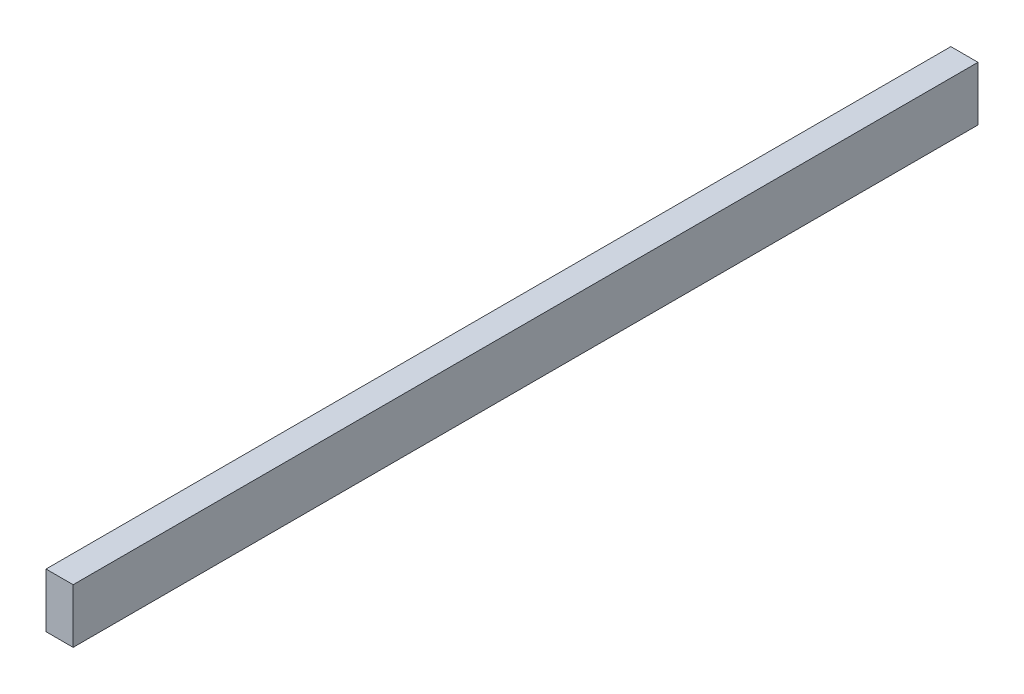
ISO-10303-21;
HEADER;
FILE_DESCRIPTION(('STEP AP214'),'2;1');
FILE_NAME('part.step','',(''),(''),'','','');
FILE_SCHEMA(('AUTOMOTIVE_DESIGN { 1 0 10303 214 1 1 1 1 }'));
ENDSEC;
DATA;
#1=APPLICATION_CONTEXT('core data for automotive mechanical design processes');
#2=APPLICATION_PROTOCOL_DEFINITION('international standard','automotive_design',2000,#1);
#3=PRODUCT_CONTEXT('',#1,'mechanical');
#4=PRODUCT('Part','Part','',(#3));
#5=PRODUCT_RELATED_PRODUCT_CATEGORY('part','',(#4));
#6=PRODUCT_DEFINITION_FORMATION('','',#4);
#7=PRODUCT_DEFINITION_CONTEXT('part definition',#1,'design');
#8=PRODUCT_DEFINITION('design','',#6,#7);
#9=PRODUCT_DEFINITION_SHAPE('','',#8);
#10=(LENGTH_UNIT() NAMED_UNIT(*) SI_UNIT(.MILLI.,.METRE.));
#11=(NAMED_UNIT(*) PLANE_ANGLE_UNIT() SI_UNIT($,.RADIAN.));
#12=(NAMED_UNIT(*) SI_UNIT($,.STERADIAN.) SOLID_ANGLE_UNIT());
#13=UNCERTAINTY_MEASURE_WITH_UNIT(LENGTH_MEASURE(1.E-05),#10,'distance_accuracy_value','');
#14=(GEOMETRIC_REPRESENTATION_CONTEXT(3) GLOBAL_UNCERTAINTY_ASSIGNED_CONTEXT((#13)) GLOBAL_UNIT_ASSIGNED_CONTEXT((#10,
#11,#12)) REPRESENTATION_CONTEXT('',''));
#15=CARTESIAN_POINT('',(0.,0.,0.));
#16=DIRECTION('',(0.,0.,1.));
#17=DIRECTION('',(1.,0.,0.));
#18=AXIS2_PLACEMENT_3D('',#15,#16,#17);
#19=CARTESIAN_POINT('',(0.,-2.7952788750285,100.));
#20=DIRECTION('',(-1.,0.,0.));
#21=DIRECTION('',(0.,-1.,0.));
#22=AXIS2_PLACEMENT_3D('',#19,#20,#21);
#23=PLANE('',#22);
#24=DIRECTION('',(0.,1.,0.));
#25=VECTOR('',#24,1.);
#26=CARTESIAN_POINT('',(0.,-2.7952788750285,0.));
#27=LINE('',#26,#25);
#28=CARTESIAN_POINT('',(0.,-2.7952788750285,0.));
#29=VERTEX_POINT('',#28);
#30=CARTESIAN_POINT('',(0.,3.2047211249715,0.));
#31=VERTEX_POINT('',#30);
#32=EDGE_CURVE('E96',#29,#31,#27,.T.);
#33=ORIENTED_EDGE('',*,*,#32,.T.);
#34=DIRECTION('',(0.,0.,-1.));
#35=VECTOR('',#34,1.);
#36=CARTESIAN_POINT('',(0.,3.2047211249715,100.));
#37=LINE('',#36,#35);
#38=CARTESIAN_POINT('',(0.,3.2047211249715,100.));
#39=VERTEX_POINT('',#38);
#40=EDGE_CURVE('E11',#39,#31,#37,.T.);
#41=ORIENTED_EDGE('',*,*,#40,.F.);
#42=DIRECTION('',(0.,1.,0.));
#43=VECTOR('',#42,1.);
#44=CARTESIAN_POINT('',(0.,-2.7952788750285,100.));
#45=LINE('',#44,#43);
#46=CARTESIAN_POINT('',(0.,-2.7952788750285,100.));
#47=VERTEX_POINT('',#46);
#48=EDGE_CURVE('E84',#47,#39,#45,.T.);
#49=ORIENTED_EDGE('',*,*,#48,.F.);
#50=DIRECTION('',(0.,0.,-1.));
#51=VECTOR('',#50,1.);
#52=CARTESIAN_POINT('',(0.,-2.7952788750285,100.));
#53=LINE('',#52,#51);
#54=EDGE_CURVE('E92',#47,#29,#53,.T.);
#55=ORIENTED_EDGE('',*,*,#54,.T.);
#56=EDGE_LOOP('',(#33,#41,#49,#55));
#57=FACE_BOUND('',#56,.T.);
#58=ADVANCED_FACE('F33',(#57),#23,.F.);
#59=CARTESIAN_POINT('',(0.,3.2047211249715,100.));
#60=DIRECTION('',(0.,-1.,0.));
#61=DIRECTION('',(0.,0.,-1.));
#62=AXIS2_PLACEMENT_3D('',#59,#60,#61);
#63=PLANE('',#62);
#64=DIRECTION('',(-1.,0.,0.));
#65=VECTOR('',#64,1.);
#66=CARTESIAN_POINT('',(0.,3.2047211249715,0.));
#67=LINE('',#66,#65);
#68=CARTESIAN_POINT('',(-3.,3.2047211249715,0.));
#69=VERTEX_POINT('',#68);
#70=EDGE_CURVE('E88',#31,#69,#67,.T.);
#71=ORIENTED_EDGE('',*,*,#70,.T.);
#72=DIRECTION('',(0.,0.,-1.));
#73=VECTOR('',#72,1.);
#74=CARTESIAN_POINT('',(-3.,3.2047211249715,100.));
#75=LINE('',#74,#73);
#76=CARTESIAN_POINT('',(-3.,3.2047211249715,100.));
#77=VERTEX_POINT('',#76);
#78=EDGE_CURVE('E41',#77,#69,#75,.T.);
#79=ORIENTED_EDGE('',*,*,#78,.F.);
#80=DIRECTION('',(-1.,0.,0.));
#81=VECTOR('',#80,1.);
#82=CARTESIAN_POINT('',(0.,3.2047211249715,100.));
#83=LINE('',#82,#81);
#84=EDGE_CURVE('E79',#39,#77,#83,.T.);
#85=ORIENTED_EDGE('',*,*,#84,.F.);
#86=ORIENTED_EDGE('',*,*,#40,.T.);
#87=EDGE_LOOP('',(#71,#79,#85,#86));
#88=FACE_BOUND('',#87,.T.);
#89=ADVANCED_FACE('F87',(#88),#63,.F.);
#90=CARTESIAN_POINT('',(-3.,-2.7952788750285,100.));
#91=DIRECTION('',(1.,0.,0.));
#92=DIRECTION('',(0.,0.,-1.));
#93=AXIS2_PLACEMENT_3D('',#90,#91,#92);
#94=PLANE('',#93);
#95=DIRECTION('',(0.,-1.,0.));
#96=VECTOR('',#95,1.);
#97=CARTESIAN_POINT('',(-3.,-2.7952788750285,0.));
#98=LINE('',#97,#96);
#99=CARTESIAN_POINT('',(-3.,-2.7952788750285,0.));
#100=VERTEX_POINT('',#99);
#101=EDGE_CURVE('E66',#69,#100,#98,.T.);
#102=ORIENTED_EDGE('',*,*,#101,.T.);
#103=DIRECTION('',(0.,0.,-1.));
#104=VECTOR('',#103,1.);
#105=CARTESIAN_POINT('',(-3.,-2.7952788750285,100.));
#106=LINE('',#105,#104);
#107=CARTESIAN_POINT('',(-3.,-2.7952788750285,100.));
#108=VERTEX_POINT('',#107);
#109=EDGE_CURVE('E89',#108,#100,#106,.T.);
#110=ORIENTED_EDGE('',*,*,#109,.F.);
#111=DIRECTION('',(0.,-1.,0.));
#112=VECTOR('',#111,1.);
#113=CARTESIAN_POINT('',(-3.,-2.7952788750285,100.));
#114=LINE('',#113,#112);
#115=EDGE_CURVE('E82',#77,#108,#114,.T.);
#116=ORIENTED_EDGE('',*,*,#115,.F.);
#117=ORIENTED_EDGE('',*,*,#78,.T.);
#118=EDGE_LOOP('',(#102,#110,#116,#117));
#119=FACE_BOUND('',#118,.T.);
#120=ADVANCED_FACE('F90',(#119),#94,.F.);
#121=CARTESIAN_POINT('',(0.,-2.7952788750285,100.));
#122=DIRECTION('',(0.,1.,0.));
#123=DIRECTION('',(-1.,0.,0.));
#124=AXIS2_PLACEMENT_3D('',#121,#122,#123);
#125=PLANE('',#124);
#126=DIRECTION('',(1.,0.,0.));
#127=VECTOR('',#126,1.);
#128=CARTESIAN_POINT('',(0.,-2.7952788750285,0.));
#129=LINE('',#128,#127);
#130=EDGE_CURVE('E72',#100,#29,#129,.T.);
#131=ORIENTED_EDGE('',*,*,#130,.T.);
#132=ORIENTED_EDGE('',*,*,#54,.F.);
#133=DIRECTION('',(1.,0.,0.));
#134=VECTOR('',#133,1.);
#135=CARTESIAN_POINT('',(0.,-2.7952788750285,100.));
#136=LINE('',#135,#134);
#137=EDGE_CURVE('E49',#108,#47,#136,.T.);
#138=ORIENTED_EDGE('',*,*,#137,.F.);
#139=ORIENTED_EDGE('',*,*,#109,.T.);
#140=EDGE_LOOP('',(#131,#132,#138,#139));
#141=FACE_BOUND('',#140,.T.);
#142=ADVANCED_FACE('F103',(#141),#125,.F.);
#143=CARTESIAN_POINT('',(0.,0.,100.));
#144=DIRECTION('',(0.,0.,1.));
#145=DIRECTION('',(1.,0.,0.));
#146=AXIS2_PLACEMENT_3D('',#143,#144,#145);
#147=PLANE('',#146);
#148=ORIENTED_EDGE('',*,*,#48,.T.);
#149=ORIENTED_EDGE('',*,*,#84,.T.);
#150=ORIENTED_EDGE('',*,*,#115,.T.);
#151=ORIENTED_EDGE('',*,*,#137,.T.);
#152=EDGE_LOOP('',(#148,#149,#150,#151));
#153=FACE_BOUND('',#152,.T.);
#154=ADVANCED_FACE('F80',(#153),#147,.T.);
#155=CARTESIAN_POINT('',(0.,0.,0.));
#156=DIRECTION('',(0.,0.,1.));
#157=DIRECTION('',(1.,0.,0.));
#158=AXIS2_PLACEMENT_3D('',#155,#156,#157);
#159=PLANE('',#158);
#160=ORIENTED_EDGE('',*,*,#32,.F.);
#161=ORIENTED_EDGE('',*,*,#130,.F.);
#162=ORIENTED_EDGE('',*,*,#101,.F.);
#163=ORIENTED_EDGE('',*,*,#70,.F.);
#164=EDGE_LOOP('',(#160,#161,#162,#163));
#165=FACE_BOUND('',#164,.T.);
#166=ADVANCED_FACE('F106',(#165),#159,.F.);
#167=CLOSED_SHELL('',(#58,#89,#120,#142,#154,#166));
#168=MANIFOLD_SOLID_BREP('B2',#167);
#169=ADVANCED_BREP_SHAPE_REPRESENTATION('',(#18,#168),#14);
#170=SHAPE_DEFINITION_REPRESENTATION(#9,#169);
ENDSEC;
END-ISO-10303-21;
